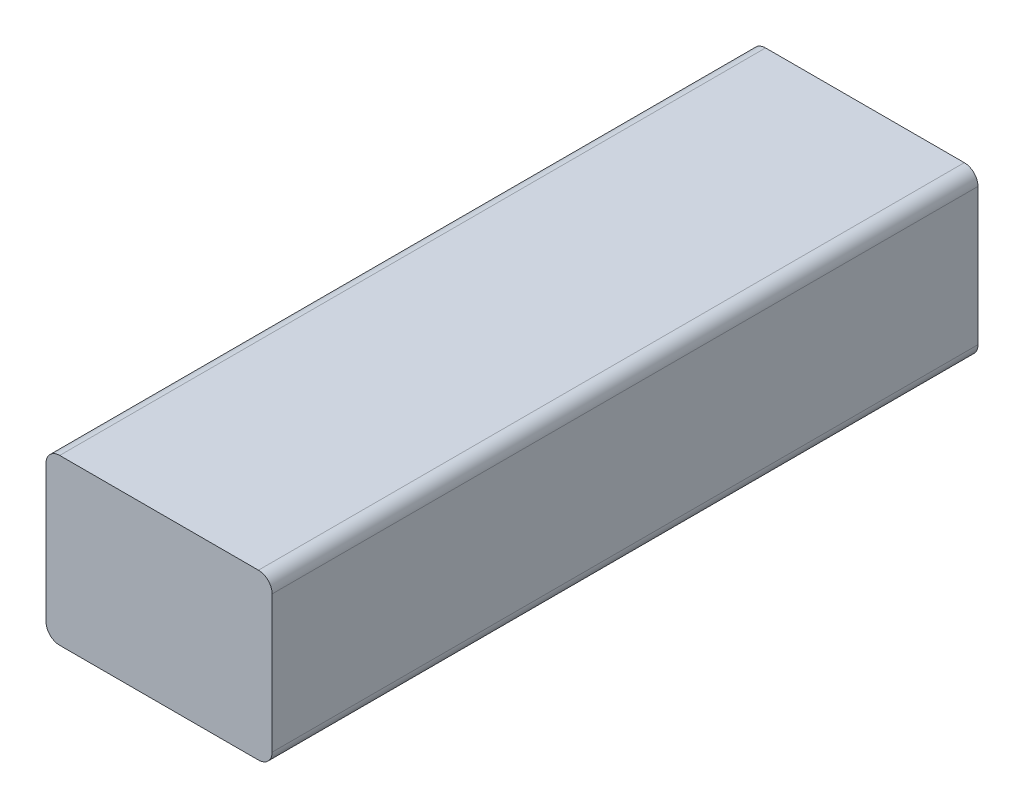
ISO-10303-21;
HEADER;
FILE_DESCRIPTION(('STEP AP214'),'2;1');
FILE_NAME('part.step','',(''),(''),'','','');
FILE_SCHEMA(('AUTOMOTIVE_DESIGN { 1 0 10303 214 1 1 1 1 }'));
ENDSEC;
DATA;
#1=APPLICATION_CONTEXT('core data for automotive mechanical design processes');
#2=APPLICATION_PROTOCOL_DEFINITION('international standard','automotive_design',2000,#1);
#3=PRODUCT_CONTEXT('',#1,'mechanical');
#4=PRODUCT('Part','Part','',(#3));
#5=PRODUCT_RELATED_PRODUCT_CATEGORY('part','',(#4));
#6=PRODUCT_DEFINITION_FORMATION('','',#4);
#7=PRODUCT_DEFINITION_CONTEXT('part definition',#1,'design');
#8=PRODUCT_DEFINITION('design','',#6,#7);
#9=PRODUCT_DEFINITION_SHAPE('','',#8);
#10=(LENGTH_UNIT() NAMED_UNIT(*) SI_UNIT(.MILLI.,.METRE.));
#11=(NAMED_UNIT(*) PLANE_ANGLE_UNIT() SI_UNIT($,.RADIAN.));
#12=(NAMED_UNIT(*) SI_UNIT($,.STERADIAN.) SOLID_ANGLE_UNIT());
#13=UNCERTAINTY_MEASURE_WITH_UNIT(LENGTH_MEASURE(1.E-05),#10,'distance_accuracy_value','');
#14=(GEOMETRIC_REPRESENTATION_CONTEXT(3) GLOBAL_UNCERTAINTY_ASSIGNED_CONTEXT((#13)) GLOBAL_UNIT_ASSIGNED_CONTEXT((#10,
#11,#12)) REPRESENTATION_CONTEXT('',''));
#15=CARTESIAN_POINT('',(0.,0.,0.));
#16=DIRECTION('',(0.,0.,1.));
#17=DIRECTION('',(1.,0.,0.));
#18=AXIS2_PLACEMENT_3D('',#15,#16,#17);
#19=CARTESIAN_POINT('',(16.5,24.,51.5));
#20=DIRECTION('',(-1.,0.,0.));
#21=DIRECTION('',(0.,0.,1.));
#22=AXIS2_PLACEMENT_3D('',#19,#20,#21);
#23=PLANE('',#22);
#24=DIRECTION('',(0.,-1.,0.));
#25=VECTOR('',#24,1.);
#26=CARTESIAN_POINT('',(16.5,24.,51.5));
#27=LINE('',#26,#25);
#28=CARTESIAN_POINT('',(16.5,22.,51.5));
#29=VERTEX_POINT('',#28);
#30=CARTESIAN_POINT('',(16.5,2.,51.5));
#31=VERTEX_POINT('',#30);
#32=EDGE_CURVE('E122',#29,#31,#27,.T.);
#33=ORIENTED_EDGE('',*,*,#32,.T.);
#34=DIRECTION('',(0.,0.,-1.));
#35=VECTOR('',#34,1.);
#36=CARTESIAN_POINT('',(16.5,2.,-51.5));
#37=LINE('',#36,#35);
#38=CARTESIAN_POINT('',(16.5,2.,-51.5));
#39=VERTEX_POINT('',#38);
#40=EDGE_CURVE('E11',#31,#39,#37,.T.);
#41=ORIENTED_EDGE('',*,*,#40,.T.);
#42=DIRECTION('',(0.,-1.,0.));
#43=VECTOR('',#42,1.);
#44=CARTESIAN_POINT('',(16.5,24.,-51.5));
#45=LINE('',#44,#43);
#46=CARTESIAN_POINT('',(16.5,22.,-51.5));
#47=VERTEX_POINT('',#46);
#48=EDGE_CURVE('E127',#47,#39,#45,.T.);
#49=ORIENTED_EDGE('',*,*,#48,.F.);
#50=DIRECTION('',(0.,0.,-1.));
#51=VECTOR('',#50,1.);
#52=CARTESIAN_POINT('',(16.5,22.,51.5));
#53=LINE('',#52,#51);
#54=EDGE_CURVE('E42',#47,#29,#53,.F.);
#55=ORIENTED_EDGE('',*,*,#54,.T.);
#56=EDGE_LOOP('',(#33,#41,#49,#55));
#57=FACE_BOUND('',#56,.T.);
#58=ADVANCED_FACE('F34',(#57),#23,.F.);
#59=CARTESIAN_POINT('',(-16.5,24.,-51.5));
#60=DIRECTION('',(0.,0.,1.));
#61=DIRECTION('',(1.,0.,0.));
#62=AXIS2_PLACEMENT_3D('',#59,#60,#61);
#63=PLANE('',#62);
#64=DIRECTION('',(-1.,0.,0.));
#65=VECTOR('',#64,1.);
#66=CARTESIAN_POINT('',(-16.5,0.,-51.5));
#67=LINE('',#66,#65);
#68=CARTESIAN_POINT('',(14.5,0.,-51.5));
#69=VERTEX_POINT('',#68);
#70=CARTESIAN_POINT('',(-14.5,0.,-51.5));
#71=VERTEX_POINT('',#70);
#72=EDGE_CURVE('E169',#69,#71,#67,.T.);
#73=ORIENTED_EDGE('',*,*,#72,.T.);
#74=CARTESIAN_POINT('',(-14.5,2.,-51.5));
#75=DIRECTION('',(0.,0.,1.));
#76=DIRECTION('',(1.,0.,0.));
#77=AXIS2_PLACEMENT_3D('',#74,#75,#76);
#78=CIRCLE('',#77,2.);
#79=CARTESIAN_POINT('',(-16.5,2.,-51.5));
#80=VERTEX_POINT('',#79);
#81=EDGE_CURVE('E144',#71,#80,#78,.F.);
#82=ORIENTED_EDGE('',*,*,#81,.T.);
#83=DIRECTION('',(0.,-1.,0.));
#84=VECTOR('',#83,1.);
#85=CARTESIAN_POINT('',(-16.5,24.,-51.5));
#86=LINE('',#85,#84);
#87=CARTESIAN_POINT('',(-16.5,22.,-51.5));
#88=VERTEX_POINT('',#87);
#89=EDGE_CURVE('E121',#88,#80,#86,.T.);
#90=ORIENTED_EDGE('',*,*,#89,.F.);
#91=CARTESIAN_POINT('',(-14.5,22.,-51.5));
#92=DIRECTION('',(0.,0.,1.));
#93=DIRECTION('',(1.,0.,0.));
#94=AXIS2_PLACEMENT_3D('',#91,#92,#93);
#95=CIRCLE('',#94,2.);
#96=CARTESIAN_POINT('',(-14.5,24.,-51.5));
#97=VERTEX_POINT('',#96);
#98=EDGE_CURVE('E126',#88,#97,#95,.F.);
#99=ORIENTED_EDGE('',*,*,#98,.T.);
#100=DIRECTION('',(-1.,0.,0.));
#101=VECTOR('',#100,1.);
#102=CARTESIAN_POINT('',(-16.5,24.,-51.5));
#103=LINE('',#102,#101);
#104=CARTESIAN_POINT('',(14.5,24.,-51.5));
#105=VERTEX_POINT('',#104);
#106=EDGE_CURVE('E163',#105,#97,#103,.T.);
#107=ORIENTED_EDGE('',*,*,#106,.F.);
#108=CARTESIAN_POINT('',(14.5,22.,-51.5));
#109=DIRECTION('',(0.,0.,1.));
#110=DIRECTION('',(1.,0.,0.));
#111=AXIS2_PLACEMENT_3D('',#108,#109,#110);
#112=CIRCLE('',#111,2.);
#113=EDGE_CURVE('E56',#105,#47,#112,.F.);
#114=ORIENTED_EDGE('',*,*,#113,.T.);
#115=ORIENTED_EDGE('',*,*,#48,.T.);
#116=CARTESIAN_POINT('',(14.5,2.,-51.5));
#117=DIRECTION('',(0.,0.,1.));
#118=DIRECTION('',(1.,0.,0.));
#119=AXIS2_PLACEMENT_3D('',#116,#117,#118);
#120=CIRCLE('',#119,2.);
#121=EDGE_CURVE('E49',#39,#69,#120,.F.);
#122=ORIENTED_EDGE('',*,*,#121,.T.);
#123=EDGE_LOOP('',(#73,#82,#90,#99,#107,#114,#115,#122));
#124=FACE_BOUND('',#123,.T.);
#125=ADVANCED_FACE('F165',(#124),#63,.F.);
#126=CARTESIAN_POINT('',(-16.5,24.,51.5));
#127=DIRECTION('',(1.,0.,0.));
#128=DIRECTION('',(0.,0.,-1.));
#129=AXIS2_PLACEMENT_3D('',#126,#127,#128);
#130=PLANE('',#129);
#131=ORIENTED_EDGE('',*,*,#89,.T.);
#132=DIRECTION('',(0.,0.,1.));
#133=VECTOR('',#132,1.);
#134=CARTESIAN_POINT('',(-16.5,2.,51.5));
#135=LINE('',#134,#133);
#136=CARTESIAN_POINT('',(-16.5,2.,51.5));
#137=VERTEX_POINT('',#136);
#138=EDGE_CURVE('E120',#80,#137,#135,.T.);
#139=ORIENTED_EDGE('',*,*,#138,.T.);
#140=DIRECTION('',(0.,-1.,0.));
#141=VECTOR('',#140,1.);
#142=CARTESIAN_POINT('',(-16.5,24.,51.5));
#143=LINE('',#142,#141);
#144=CARTESIAN_POINT('',(-16.5,22.,51.5));
#145=VERTEX_POINT('',#144);
#146=EDGE_CURVE('E103',#145,#137,#143,.T.);
#147=ORIENTED_EDGE('',*,*,#146,.F.);
#148=DIRECTION('',(0.,0.,1.));
#149=VECTOR('',#148,1.);
#150=CARTESIAN_POINT('',(-16.5,22.,51.5));
#151=LINE('',#150,#149);
#152=EDGE_CURVE('E117',#145,#88,#151,.F.);
#153=ORIENTED_EDGE('',*,*,#152,.T.);
#154=EDGE_LOOP('',(#131,#139,#147,#153));
#155=FACE_BOUND('',#154,.T.);
#156=ADVANCED_FACE('F116',(#155),#130,.F.);
#157=CARTESIAN_POINT('',(-16.5,24.,51.5));
#158=DIRECTION('',(0.,0.,-1.));
#159=DIRECTION('',(-1.,0.,0.));
#160=AXIS2_PLACEMENT_3D('',#157,#158,#159);
#161=PLANE('',#160);
#162=ORIENTED_EDGE('',*,*,#146,.T.);
#163=CARTESIAN_POINT('',(-14.5,2.,51.5));
#164=DIRECTION('',(0.,0.,-1.));
#165=DIRECTION('',(-1.,0.,0.));
#166=AXIS2_PLACEMENT_3D('',#163,#164,#165);
#167=CIRCLE('',#166,2.);
#168=CARTESIAN_POINT('',(-14.5,0.,51.5));
#169=VERTEX_POINT('',#168);
#170=EDGE_CURVE('E110',#137,#169,#167,.F.);
#171=ORIENTED_EDGE('',*,*,#170,.T.);
#172=DIRECTION('',(1.,0.,0.));
#173=VECTOR('',#172,1.);
#174=CARTESIAN_POINT('',(-16.5,0.,51.5));
#175=LINE('',#174,#173);
#176=CARTESIAN_POINT('',(14.5,0.,51.5));
#177=VERTEX_POINT('',#176);
#178=EDGE_CURVE('E166',#169,#177,#175,.T.);
#179=ORIENTED_EDGE('',*,*,#178,.T.);
#180=CARTESIAN_POINT('',(14.5,2.,51.5));
#181=DIRECTION('',(0.,0.,-1.));
#182=DIRECTION('',(-1.,0.,0.));
#183=AXIS2_PLACEMENT_3D('',#180,#181,#182);
#184=CIRCLE('',#183,2.);
#185=EDGE_CURVE('E111',#177,#31,#184,.F.);
#186=ORIENTED_EDGE('',*,*,#185,.T.);
#187=ORIENTED_EDGE('',*,*,#32,.F.);
#188=CARTESIAN_POINT('',(14.5,22.,51.5));
#189=DIRECTION('',(0.,0.,-1.));
#190=DIRECTION('',(-1.,0.,0.));
#191=AXIS2_PLACEMENT_3D('',#188,#189,#190);
#192=CIRCLE('',#191,2.);
#193=CARTESIAN_POINT('',(14.5,24.,51.5));
#194=VERTEX_POINT('',#193);
#195=EDGE_CURVE('E129',#29,#194,#192,.F.);
#196=ORIENTED_EDGE('',*,*,#195,.T.);
#197=DIRECTION('',(1.,0.,0.));
#198=VECTOR('',#197,1.);
#199=CARTESIAN_POINT('',(-16.5,24.,51.5));
#200=LINE('',#199,#198);
#201=CARTESIAN_POINT('',(-14.5,24.,51.5));
#202=VERTEX_POINT('',#201);
#203=EDGE_CURVE('E105',#202,#194,#200,.T.);
#204=ORIENTED_EDGE('',*,*,#203,.F.);
#205=CARTESIAN_POINT('',(-14.5,22.,51.5));
#206=DIRECTION('',(0.,0.,-1.));
#207=DIRECTION('',(-1.,0.,0.));
#208=AXIS2_PLACEMENT_3D('',#205,#206,#207);
#209=CIRCLE('',#208,2.);
#210=EDGE_CURVE('E100',#202,#145,#209,.F.);
#211=ORIENTED_EDGE('',*,*,#210,.T.);
#212=EDGE_LOOP('',(#162,#171,#179,#186,#187,#196,#204,#211));
#213=FACE_BOUND('',#212,.T.);
#214=ADVANCED_FACE('F102',(#213),#161,.F.);
#215=CARTESIAN_POINT('',(0.,24.,0.));
#216=DIRECTION('',(0.,-1.,0.));
#217=DIRECTION('',(0.,0.,-1.));
#218=AXIS2_PLACEMENT_3D('',#215,#216,#217);
#219=PLANE('',#218);
#220=ORIENTED_EDGE('',*,*,#106,.T.);
#221=DIRECTION('',(0.,0.,1.));
#222=VECTOR('',#221,1.);
#223=CARTESIAN_POINT('',(-14.5,24.,0.));
#224=LINE('',#223,#222);
#225=EDGE_CURVE('E149',#97,#202,#224,.T.);
#226=ORIENTED_EDGE('',*,*,#225,.T.);
#227=ORIENTED_EDGE('',*,*,#203,.T.);
#228=DIRECTION('',(0.,0.,-1.));
#229=VECTOR('',#228,1.);
#230=CARTESIAN_POINT('',(14.5,24.,0.));
#231=LINE('',#230,#229);
#232=EDGE_CURVE('E146',#194,#105,#231,.T.);
#233=ORIENTED_EDGE('',*,*,#232,.T.);
#234=EDGE_LOOP('',(#220,#226,#227,#233));
#235=FACE_BOUND('',#234,.T.);
#236=ADVANCED_FACE('F162',(#235),#219,.F.);
#237=CARTESIAN_POINT('',(0.,0.,0.));
#238=DIRECTION('',(0.,-1.,0.));
#239=DIRECTION('',(0.,0.,-1.));
#240=AXIS2_PLACEMENT_3D('',#237,#238,#239);
#241=PLANE('',#240);
#242=ORIENTED_EDGE('',*,*,#178,.F.);
#243=DIRECTION('',(0.,0.,1.));
#244=VECTOR('',#243,1.);
#245=CARTESIAN_POINT('',(-14.5,0.,-51.5));
#246=LINE('',#245,#244);
#247=EDGE_CURVE('E139',#169,#71,#246,.F.);
#248=ORIENTED_EDGE('',*,*,#247,.T.);
#249=ORIENTED_EDGE('',*,*,#72,.F.);
#250=DIRECTION('',(0.,0.,-1.));
#251=VECTOR('',#250,1.);
#252=CARTESIAN_POINT('',(14.5,0.,51.5));
#253=LINE('',#252,#251);
#254=EDGE_CURVE('E137',#69,#177,#253,.F.);
#255=ORIENTED_EDGE('',*,*,#254,.T.);
#256=EDGE_LOOP('',(#242,#248,#249,#255));
#257=FACE_BOUND('',#256,.T.);
#258=ADVANCED_FACE('F178',(#257),#241,.T.);
#259=CARTESIAN_POINT('',(-14.5,2.,51.5));
#260=DIRECTION('',(0.,0.,-1.));
#261=DIRECTION('',(-1.,0.,0.));
#262=AXIS2_PLACEMENT_3D('',#259,#260,#261);
#263=CYLINDRICAL_SURFACE('',#262,2.);
#264=ORIENTED_EDGE('',*,*,#81,.F.);
#265=ORIENTED_EDGE('',*,*,#247,.F.);
#266=ORIENTED_EDGE('',*,*,#170,.F.);
#267=ORIENTED_EDGE('',*,*,#138,.F.);
#268=EDGE_LOOP('',(#264,#265,#266,#267));
#269=FACE_BOUND('',#268,.T.);
#270=ADVANCED_FACE('F174',(#269),#263,.T.);
#271=CARTESIAN_POINT('',(-14.5,22.,0.));
#272=DIRECTION('',(0.,0.,1.));
#273=DIRECTION('',(1.,0.,0.));
#274=AXIS2_PLACEMENT_3D('',#271,#272,#273);
#275=CYLINDRICAL_SURFACE('',#274,2.);
#276=ORIENTED_EDGE('',*,*,#98,.F.);
#277=ORIENTED_EDGE('',*,*,#152,.F.);
#278=ORIENTED_EDGE('',*,*,#210,.F.);
#279=ORIENTED_EDGE('',*,*,#225,.F.);
#280=EDGE_LOOP('',(#276,#277,#278,#279));
#281=FACE_BOUND('',#280,.T.);
#282=ADVANCED_FACE('F125',(#281),#275,.T.);
#283=CARTESIAN_POINT('',(14.5,2.,51.5));
#284=DIRECTION('',(0.,0.,1.));
#285=DIRECTION('',(1.,0.,0.));
#286=AXIS2_PLACEMENT_3D('',#283,#284,#285);
#287=CYLINDRICAL_SURFACE('',#286,2.);
#288=ORIENTED_EDGE('',*,*,#185,.F.);
#289=ORIENTED_EDGE('',*,*,#254,.F.);
#290=ORIENTED_EDGE('',*,*,#121,.F.);
#291=ORIENTED_EDGE('',*,*,#40,.F.);
#292=EDGE_LOOP('',(#288,#289,#290,#291));
#293=FACE_BOUND('',#292,.T.);
#294=ADVANCED_FACE('F180',(#293),#287,.T.);
#295=CARTESIAN_POINT('',(14.5,22.,0.));
#296=DIRECTION('',(0.,0.,-1.));
#297=DIRECTION('',(-1.,0.,0.));
#298=AXIS2_PLACEMENT_3D('',#295,#296,#297);
#299=CYLINDRICAL_SURFACE('',#298,2.);
#300=ORIENTED_EDGE('',*,*,#195,.F.);
#301=ORIENTED_EDGE('',*,*,#54,.F.);
#302=ORIENTED_EDGE('',*,*,#113,.F.);
#303=ORIENTED_EDGE('',*,*,#232,.F.);
#304=EDGE_LOOP('',(#300,#301,#302,#303));
#305=FACE_BOUND('',#304,.T.);
#306=ADVANCED_FACE('F36',(#305),#299,.T.);
#307=CLOSED_SHELL('',(#58,#125,#156,#214,#236,#258,#270,#282,#294,#306));
#308=MANIFOLD_SOLID_BREP('B2',#307);
#309=ADVANCED_BREP_SHAPE_REPRESENTATION('',(#18,#308),#14);
#310=SHAPE_DEFINITION_REPRESENTATION(#9,#309);
ENDSEC;
END-ISO-10303-21;
